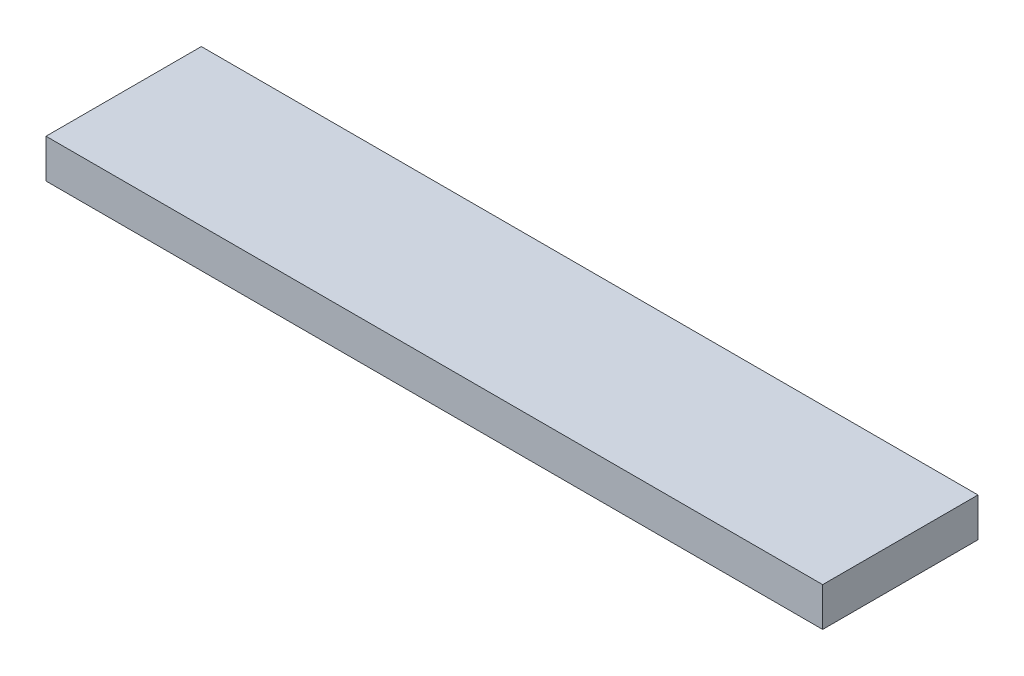
ISO-10303-21;
HEADER;
FILE_DESCRIPTION(('STEP AP214'),'2;1');
FILE_NAME('part.step','',(''),(''),'','','');
FILE_SCHEMA(('AUTOMOTIVE_DESIGN { 1 0 10303 214 1 1 1 1 }'));
ENDSEC;
DATA;
#1=APPLICATION_CONTEXT('core data for automotive mechanical design processes');
#2=APPLICATION_PROTOCOL_DEFINITION('international standard','automotive_design',2000,#1);
#3=PRODUCT_CONTEXT('',#1,'mechanical');
#4=PRODUCT('Part','Part','',(#3));
#5=PRODUCT_RELATED_PRODUCT_CATEGORY('part','',(#4));
#6=PRODUCT_DEFINITION_FORMATION('','',#4);
#7=PRODUCT_DEFINITION_CONTEXT('part definition',#1,'design');
#8=PRODUCT_DEFINITION('design','',#6,#7);
#9=PRODUCT_DEFINITION_SHAPE('','',#8);
#10=(LENGTH_UNIT() NAMED_UNIT(*) SI_UNIT(.MILLI.,.METRE.));
#11=(NAMED_UNIT(*) PLANE_ANGLE_UNIT() SI_UNIT($,.RADIAN.));
#12=(NAMED_UNIT(*) SI_UNIT($,.STERADIAN.) SOLID_ANGLE_UNIT());
#13=UNCERTAINTY_MEASURE_WITH_UNIT(LENGTH_MEASURE(1.E-05),#10,'distance_accuracy_value','');
#14=(GEOMETRIC_REPRESENTATION_CONTEXT(3) GLOBAL_UNCERTAINTY_ASSIGNED_CONTEXT((#13)) GLOBAL_UNIT_ASSIGNED_CONTEXT((#10,
#11,#12)) REPRESENTATION_CONTEXT('',''));
#15=CARTESIAN_POINT('',(0.,0.,0.));
#16=DIRECTION('',(0.,0.,1.));
#17=DIRECTION('',(1.,0.,0.));
#18=AXIS2_PLACEMENT_3D('',#15,#16,#17);
#19=CARTESIAN_POINT('',(63.5,6.35,-12.7));
#20=DIRECTION('',(-1.,0.,0.));
#21=DIRECTION('',(0.,0.,1.));
#22=AXIS2_PLACEMENT_3D('',#19,#20,#21);
#23=PLANE('',#22);
#24=DIRECTION('',(0.,0.,-1.));
#25=VECTOR('',#24,1.);
#26=CARTESIAN_POINT('',(63.5,0.,-12.7));
#27=LINE('',#26,#25);
#28=CARTESIAN_POINT('',(63.5,0.,12.7));
#29=VERTEX_POINT('',#28);
#30=CARTESIAN_POINT('',(63.5,0.,-12.7));
#31=VERTEX_POINT('',#30);
#32=EDGE_CURVE('E107',#29,#31,#27,.T.);
#33=ORIENTED_EDGE('',*,*,#32,.T.);
#34=DIRECTION('',(0.,-1.,0.));
#35=VECTOR('',#34,1.);
#36=CARTESIAN_POINT('',(63.5,6.35,-12.7));
#37=LINE('',#36,#35);
#38=CARTESIAN_POINT('',(63.5,6.35,-12.7));
#39=VERTEX_POINT('',#38);
#40=EDGE_CURVE('E11',#39,#31,#37,.T.);
#41=ORIENTED_EDGE('',*,*,#40,.F.);
#42=DIRECTION('',(0.,0.,-1.));
#43=VECTOR('',#42,1.);
#44=CARTESIAN_POINT('',(63.5,6.35,-12.7));
#45=LINE('',#44,#43);
#46=CARTESIAN_POINT('',(63.5,6.35,12.7));
#47=VERTEX_POINT('',#46);
#48=EDGE_CURVE('E91',#47,#39,#45,.T.);
#49=ORIENTED_EDGE('',*,*,#48,.F.);
#50=DIRECTION('',(0.,-1.,0.));
#51=VECTOR('',#50,1.);
#52=CARTESIAN_POINT('',(63.5,6.35,12.7));
#53=LINE('',#52,#51);
#54=EDGE_CURVE('E103',#47,#29,#53,.T.);
#55=ORIENTED_EDGE('',*,*,#54,.T.);
#56=EDGE_LOOP('',(#33,#41,#49,#55));
#57=FACE_BOUND('',#56,.T.);
#58=ADVANCED_FACE('F39',(#57),#23,.F.);
#59=CARTESIAN_POINT('',(-63.5,6.35,-12.7));
#60=DIRECTION('',(0.,0.,1.));
#61=DIRECTION('',(1.,0.,0.));
#62=AXIS2_PLACEMENT_3D('',#59,#60,#61);
#63=PLANE('',#62);
#64=DIRECTION('',(-1.,0.,0.));
#65=VECTOR('',#64,1.);
#66=CARTESIAN_POINT('',(-63.5,0.,-12.7));
#67=LINE('',#66,#65);
#68=CARTESIAN_POINT('',(-63.5,0.,-12.7));
#69=VERTEX_POINT('',#68);
#70=EDGE_CURVE('E96',#31,#69,#67,.T.);
#71=ORIENTED_EDGE('',*,*,#70,.T.);
#72=DIRECTION('',(0.,-1.,0.));
#73=VECTOR('',#72,1.);
#74=CARTESIAN_POINT('',(-63.5,6.35,-12.7));
#75=LINE('',#74,#73);
#76=CARTESIAN_POINT('',(-63.5,6.35,-12.7));
#77=VERTEX_POINT('',#76);
#78=EDGE_CURVE('E48',#77,#69,#75,.T.);
#79=ORIENTED_EDGE('',*,*,#78,.F.);
#80=DIRECTION('',(-1.,0.,0.));
#81=VECTOR('',#80,1.);
#82=CARTESIAN_POINT('',(-63.5,6.35,-12.7));
#83=LINE('',#82,#81);
#84=EDGE_CURVE('E86',#39,#77,#83,.T.);
#85=ORIENTED_EDGE('',*,*,#84,.F.);
#86=ORIENTED_EDGE('',*,*,#40,.T.);
#87=EDGE_LOOP('',(#71,#79,#85,#86));
#88=FACE_BOUND('',#87,.T.);
#89=ADVANCED_FACE('F95',(#88),#63,.F.);
#90=CARTESIAN_POINT('',(-63.5,6.35,-12.7));
#91=DIRECTION('',(1.,0.,0.));
#92=DIRECTION('',(0.,0.,-1.));
#93=AXIS2_PLACEMENT_3D('',#90,#91,#92);
#94=PLANE('',#93);
#95=DIRECTION('',(0.,0.,1.));
#96=VECTOR('',#95,1.);
#97=CARTESIAN_POINT('',(-63.5,0.,-12.7));
#98=LINE('',#97,#96);
#99=CARTESIAN_POINT('',(-63.5,0.,12.7));
#100=VERTEX_POINT('',#99);
#101=EDGE_CURVE('E73',#69,#100,#98,.T.);
#102=ORIENTED_EDGE('',*,*,#101,.T.);
#103=DIRECTION('',(0.,-1.,0.));
#104=VECTOR('',#103,1.);
#105=CARTESIAN_POINT('',(-63.5,6.35,12.7));
#106=LINE('',#105,#104);
#107=CARTESIAN_POINT('',(-63.5,6.35,12.7));
#108=VERTEX_POINT('',#107);
#109=EDGE_CURVE('E98',#108,#100,#106,.T.);
#110=ORIENTED_EDGE('',*,*,#109,.F.);
#111=DIRECTION('',(0.,0.,1.));
#112=VECTOR('',#111,1.);
#113=CARTESIAN_POINT('',(-63.5,6.35,-12.7));
#114=LINE('',#113,#112);
#115=EDGE_CURVE('E89',#77,#108,#114,.T.);
#116=ORIENTED_EDGE('',*,*,#115,.F.);
#117=ORIENTED_EDGE('',*,*,#78,.T.);
#118=EDGE_LOOP('',(#102,#110,#116,#117));
#119=FACE_BOUND('',#118,.T.);
#120=ADVANCED_FACE('F99',(#119),#94,.F.);
#121=CARTESIAN_POINT('',(-63.5,6.35,12.7));
#122=DIRECTION('',(0.,0.,-1.));
#123=DIRECTION('',(-1.,0.,0.));
#124=AXIS2_PLACEMENT_3D('',#121,#122,#123);
#125=PLANE('',#124);
#126=DIRECTION('',(1.,0.,0.));
#127=VECTOR('',#126,1.);
#128=CARTESIAN_POINT('',(-63.5,0.,12.7));
#129=LINE('',#128,#127);
#130=EDGE_CURVE('E79',#100,#29,#129,.T.);
#131=ORIENTED_EDGE('',*,*,#130,.T.);
#132=ORIENTED_EDGE('',*,*,#54,.F.);
#133=DIRECTION('',(1.,0.,0.));
#134=VECTOR('',#133,1.);
#135=CARTESIAN_POINT('',(-63.5,6.35,12.7));
#136=LINE('',#135,#134);
#137=EDGE_CURVE('E56',#108,#47,#136,.T.);
#138=ORIENTED_EDGE('',*,*,#137,.F.);
#139=ORIENTED_EDGE('',*,*,#109,.T.);
#140=EDGE_LOOP('',(#131,#132,#138,#139));
#141=FACE_BOUND('',#140,.T.);
#142=ADVANCED_FACE('F120',(#141),#125,.F.);
#143=CARTESIAN_POINT('',(0.,6.35,0.));
#144=DIRECTION('',(0.,1.,0.));
#145=DIRECTION('',(0.,0.,1.));
#146=AXIS2_PLACEMENT_3D('',#143,#144,#145);
#147=PLANE('',#146);
#148=ORIENTED_EDGE('',*,*,#48,.T.);
#149=ORIENTED_EDGE('',*,*,#84,.T.);
#150=ORIENTED_EDGE('',*,*,#115,.T.);
#151=ORIENTED_EDGE('',*,*,#137,.T.);
#152=EDGE_LOOP('',(#148,#149,#150,#151));
#153=FACE_BOUND('',#152,.T.);
#154=ADVANCED_FACE('F87',(#153),#147,.T.);
#155=CARTESIAN_POINT('',(0.,0.,0.));
#156=DIRECTION('',(0.,1.,0.));
#157=DIRECTION('',(0.,0.,1.));
#158=AXIS2_PLACEMENT_3D('',#155,#156,#157);
#159=PLANE('',#158);
#160=ORIENTED_EDGE('',*,*,#32,.F.);
#161=ORIENTED_EDGE('',*,*,#130,.F.);
#162=ORIENTED_EDGE('',*,*,#101,.F.);
#163=ORIENTED_EDGE('',*,*,#70,.F.);
#164=EDGE_LOOP('',(#160,#161,#162,#163));
#165=FACE_BOUND('',#164,.T.);
#166=ADVANCED_FACE('F123',(#165),#159,.F.);
#167=CLOSED_SHELL('',(#58,#89,#120,#142,#154,#166));
#168=MANIFOLD_SOLID_BREP('B2',#167);
#169=ADVANCED_BREP_SHAPE_REPRESENTATION('',(#18,#168),#14);
#170=SHAPE_DEFINITION_REPRESENTATION(#9,#169);
ENDSEC;
END-ISO-10303-21;
